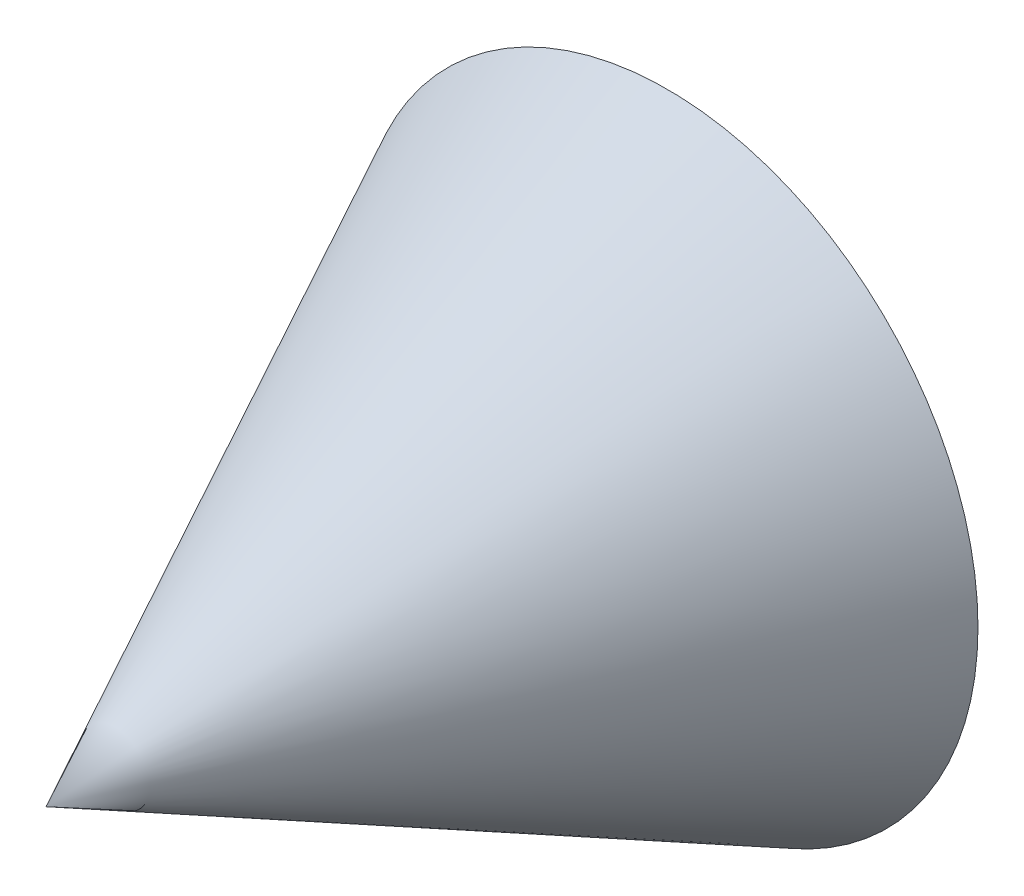
ISO-10303-21;
HEADER;
FILE_DESCRIPTION(('STEP AP214'),'2;1');
FILE_NAME('part.step','',(''),(''),'','','');
FILE_SCHEMA(('AUTOMOTIVE_DESIGN { 1 0 10303 214 1 1 1 1 }'));
ENDSEC;
DATA;
#1=APPLICATION_CONTEXT('core data for automotive mechanical design processes');
#2=APPLICATION_PROTOCOL_DEFINITION('international standard','automotive_design',2000,#1);
#3=PRODUCT_CONTEXT('',#1,'mechanical');
#4=PRODUCT('Part','Part','',(#3));
#5=PRODUCT_RELATED_PRODUCT_CATEGORY('part','',(#4));
#6=PRODUCT_DEFINITION_FORMATION('','',#4);
#7=PRODUCT_DEFINITION_CONTEXT('part definition',#1,'design');
#8=PRODUCT_DEFINITION('design','',#6,#7);
#9=PRODUCT_DEFINITION_SHAPE('','',#8);
#10=(LENGTH_UNIT() NAMED_UNIT(*) SI_UNIT(.MILLI.,.METRE.));
#11=(NAMED_UNIT(*) PLANE_ANGLE_UNIT() SI_UNIT($,.RADIAN.));
#12=(NAMED_UNIT(*) SI_UNIT($,.STERADIAN.) SOLID_ANGLE_UNIT());
#13=UNCERTAINTY_MEASURE_WITH_UNIT(LENGTH_MEASURE(1.E-05),#10,'distance_accuracy_value','');
#14=(GEOMETRIC_REPRESENTATION_CONTEXT(3) GLOBAL_UNCERTAINTY_ASSIGNED_CONTEXT((#13)) GLOBAL_UNIT_ASSIGNED_CONTEXT((#10,
#11,#12)) REPRESENTATION_CONTEXT('',''));
#15=CARTESIAN_POINT('',(0.,0.,0.));
#16=DIRECTION('',(0.,0.,1.));
#17=DIRECTION('',(1.,0.,0.));
#18=AXIS2_PLACEMENT_3D('',#15,#16,#17);
#19=CARTESIAN_POINT('',(0.,0.,0.));
#20=DIRECTION('',(0.,0.,1.));
#21=DIRECTION('',(1.,0.,0.));
#22=AXIS2_PLACEMENT_3D('',#19,#20,#21);
#23=PLANE('',#22);
#24=CARTESIAN_POINT('',(0.,0.,0.));
#25=DIRECTION('',(0.,0.,1.));
#26=DIRECTION('',(1.,0.,0.));
#27=AXIS2_PLACEMENT_3D('',#24,#25,#26);
#28=CIRCLE('',#27,50.);
#29=CARTESIAN_POINT('',(50.,0.,0.));
#30=VERTEX_POINT('',#29);
#31=EDGE_CURVE('E12',#30,#30,#28,.T.);
#32=ORIENTED_EDGE('',*,*,#31,.F.);
#33=EDGE_LOOP('',(#32));
#34=FACE_BOUND('',#33,.T.);
#35=ADVANCED_FACE('F36',(#34),#23,.F.);
#36=CARTESIAN_POINT('',(0.,0.,100.));
#37=DIRECTION('',(0.,0.,-1.));
#38=DIRECTION('',(-1.,0.,0.));
#39=AXIS2_PLACEMENT_3D('',#36,#37,#38);
#40=CONICAL_SURFACE('',#39,0.,0.463647609000806);
#41=ORIENTED_EDGE('',*,*,#31,.T.);
#42=EDGE_LOOP('',(#41));
#43=FACE_BOUND('',#42,.T.);
#44=CARTESIAN_POINT('',(0.,0.,100.));
#45=VERTEX_POINT('',#44);
#46=VERTEX_LOOP('',#45);
#47=FACE_BOUND('',#46,.T.);
#48=ADVANCED_FACE('F38',(#43,#47),#40,.T.);
#49=CLOSED_SHELL('',(#35,#48));
#50=MANIFOLD_SOLID_BREP('B2',#49);
#51=ADVANCED_BREP_SHAPE_REPRESENTATION('',(#18,#50),#14);
#52=SHAPE_DEFINITION_REPRESENTATION(#9,#51);
ENDSEC;
END-ISO-10303-21;
